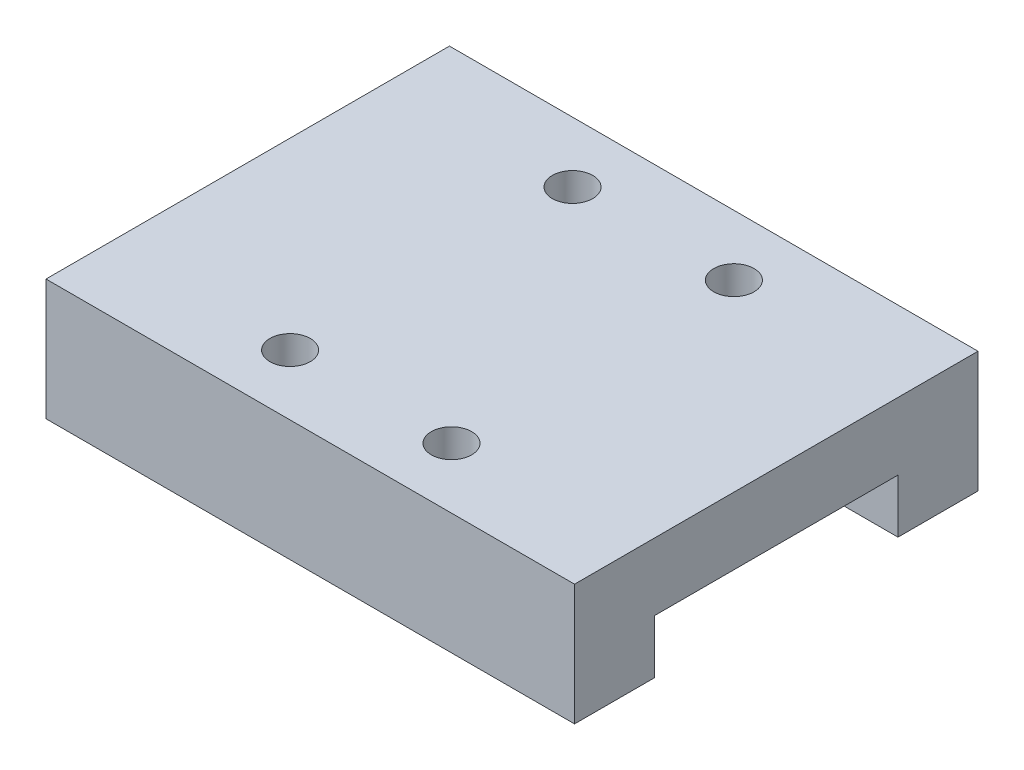
ISO-10303-21;
HEADER;
FILE_DESCRIPTION(('STEP AP214'),'2;1');
FILE_NAME('part.step','',(''),(''),'','','');
FILE_SCHEMA(('AUTOMOTIVE_DESIGN { 1 0 10303 214 1 1 1 1 }'));
ENDSEC;
DATA;
#1=APPLICATION_CONTEXT('core data for automotive mechanical design processes');
#2=APPLICATION_PROTOCOL_DEFINITION('international standard','automotive_design',2000,#1);
#3=PRODUCT_CONTEXT('',#1,'mechanical');
#4=PRODUCT('Part','Part','',(#3));
#5=PRODUCT_RELATED_PRODUCT_CATEGORY('part','',(#4));
#6=PRODUCT_DEFINITION_FORMATION('','',#4);
#7=PRODUCT_DEFINITION_CONTEXT('part definition',#1,'design');
#8=PRODUCT_DEFINITION('design','',#6,#7);
#9=PRODUCT_DEFINITION_SHAPE('','',#8);
#10=(LENGTH_UNIT() NAMED_UNIT(*) SI_UNIT(.MILLI.,.METRE.));
#11=(NAMED_UNIT(*) PLANE_ANGLE_UNIT() SI_UNIT($,.RADIAN.));
#12=(NAMED_UNIT(*) SI_UNIT($,.STERADIAN.) SOLID_ANGLE_UNIT());
#13=UNCERTAINTY_MEASURE_WITH_UNIT(LENGTH_MEASURE(1.E-05),#10,'distance_accuracy_value','');
#14=(GEOMETRIC_REPRESENTATION_CONTEXT(3) GLOBAL_UNCERTAINTY_ASSIGNED_CONTEXT((#13)) GLOBAL_UNIT_ASSIGNED_CONTEXT((#10,
#11,#12)) REPRESENTATION_CONTEXT('',''));
#15=CARTESIAN_POINT('',(0.,0.,0.));
#16=DIRECTION('',(0.,0.,1.));
#17=DIRECTION('',(1.,0.,0.));
#18=AXIS2_PLACEMENT_3D('',#15,#16,#17);
#19=CARTESIAN_POINT('',(0.,0.,0.));
#20=DIRECTION('',(0.,1.,0.));
#21=DIRECTION('',(0.,0.,1.));
#22=AXIS2_PLACEMENT_3D('',#19,#20,#21);
#23=PLANE('',#22);
#24=DIRECTION('',(0.,0.,1.));
#25=VECTOR('',#24,1.);
#26=CARTESIAN_POINT('',(-19.65,0.,-15.));
#27=LINE('',#26,#25);
#28=CARTESIAN_POINT('',(-19.65,0.,9.05));
#29=VERTEX_POINT('',#28);
#30=CARTESIAN_POINT('',(-19.65,0.,15.));
#31=VERTEX_POINT('',#30);
#32=EDGE_CURVE('E287',#29,#31,#27,.T.);
#33=ORIENTED_EDGE('',*,*,#32,.F.);
#34=DIRECTION('',(-1.,0.,0.));
#35=VECTOR('',#34,1.);
#36=CARTESIAN_POINT('',(-19.65,0.,9.05));
#37=LINE('',#36,#35);
#38=CARTESIAN_POINT('',(19.65,0.,9.05));
#39=VERTEX_POINT('',#38);
#40=EDGE_CURVE('E174',#39,#29,#37,.T.);
#41=ORIENTED_EDGE('',*,*,#40,.F.);
#42=DIRECTION('',(0.,0.,-1.));
#43=VECTOR('',#42,1.);
#44=CARTESIAN_POINT('',(19.65,0.,-15.));
#45=LINE('',#44,#43);
#46=CARTESIAN_POINT('',(19.65,0.,15.));
#47=VERTEX_POINT('',#46);
#48=EDGE_CURVE('E281',#47,#39,#45,.T.);
#49=ORIENTED_EDGE('',*,*,#48,.F.);
#50=DIRECTION('',(1.,0.,0.));
#51=VECTOR('',#50,1.);
#52=CARTESIAN_POINT('',(-19.65,0.,15.));
#53=LINE('',#52,#51);
#54=EDGE_CURVE('E271',#31,#47,#53,.T.);
#55=ORIENTED_EDGE('',*,*,#54,.F.);
#56=EDGE_LOOP('',(#33,#41,#49,#55));
#57=FACE_BOUND('',#56,.T.);
#58=ADVANCED_FACE('F39',(#57),#23,.F.);
#59=CARTESIAN_POINT('',(19.65,9.,-15.));
#60=DIRECTION('',(-1.,0.,0.));
#61=DIRECTION('',(0.,0.,1.));
#62=AXIS2_PLACEMENT_3D('',#59,#60,#61);
#63=PLANE('',#62);
#64=ORIENTED_EDGE('',*,*,#48,.T.);
#65=DIRECTION('',(0.,-1.,0.));
#66=VECTOR('',#65,1.);
#67=CARTESIAN_POINT('',(19.65,4.,9.05));
#68=LINE('',#67,#66);
#69=CARTESIAN_POINT('',(19.65,4.,9.05));
#70=VERTEX_POINT('',#69);
#71=EDGE_CURVE('E217',#70,#39,#68,.T.);
#72=ORIENTED_EDGE('',*,*,#71,.F.);
#73=DIRECTION('',(0.,0.,1.));
#74=VECTOR('',#73,1.);
#75=CARTESIAN_POINT('',(19.65,4.,9.05));
#76=LINE('',#75,#74);
#77=CARTESIAN_POINT('',(19.65,4.,-9.05));
#78=VERTEX_POINT('',#77);
#79=EDGE_CURVE('E160',#78,#70,#76,.T.);
#80=ORIENTED_EDGE('',*,*,#79,.F.);
#81=DIRECTION('',(0.,-1.,0.));
#82=VECTOR('',#81,1.);
#83=CARTESIAN_POINT('',(19.65,4.,-9.05));
#84=LINE('',#83,#82);
#85=CARTESIAN_POINT('',(19.65,0.,-9.05));
#86=VERTEX_POINT('',#85);
#87=EDGE_CURVE('E211',#78,#86,#84,.T.);
#88=ORIENTED_EDGE('',*,*,#87,.T.);
#89=CARTESIAN_POINT('',(19.65,0.,-15.));
#90=VERTEX_POINT('',#89);
#91=EDGE_CURVE('E252',#86,#90,#45,.T.);
#92=ORIENTED_EDGE('',*,*,#91,.T.);
#93=DIRECTION('',(0.,-1.,0.));
#94=VECTOR('',#93,1.);
#95=CARTESIAN_POINT('',(19.65,9.,-15.));
#96=LINE('',#95,#94);
#97=CARTESIAN_POINT('',(19.65,9.,-15.));
#98=VERTEX_POINT('',#97);
#99=EDGE_CURVE('E137',#98,#90,#96,.T.);
#100=ORIENTED_EDGE('',*,*,#99,.F.);
#101=DIRECTION('',(0.,0.,-1.));
#102=VECTOR('',#101,1.);
#103=CARTESIAN_POINT('',(19.65,9.,-15.));
#104=LINE('',#103,#102);
#105=CARTESIAN_POINT('',(19.65,9.,15.));
#106=VERTEX_POINT('',#105);
#107=EDGE_CURVE('E266',#106,#98,#104,.T.);
#108=ORIENTED_EDGE('',*,*,#107,.F.);
#109=DIRECTION('',(0.,-1.,0.));
#110=VECTOR('',#109,1.);
#111=CARTESIAN_POINT('',(19.65,9.,15.));
#112=LINE('',#111,#110);
#113=EDGE_CURVE('E280',#106,#47,#112,.T.);
#114=ORIENTED_EDGE('',*,*,#113,.T.);
#115=EDGE_LOOP('',(#64,#72,#80,#88,#92,#100,#108,#114));
#116=FACE_BOUND('',#115,.T.);
#117=ADVANCED_FACE('F41',(#116),#63,.F.);
#118=CARTESIAN_POINT('',(-19.65,9.,-15.));
#119=DIRECTION('',(0.,0.,1.));
#120=DIRECTION('',(1.,0.,0.));
#121=AXIS2_PLACEMENT_3D('',#118,#119,#120);
#122=PLANE('',#121);
#123=DIRECTION('',(-1.,0.,0.));
#124=VECTOR('',#123,1.);
#125=CARTESIAN_POINT('',(-19.65,0.,-15.));
#126=LINE('',#125,#124);
#127=CARTESIAN_POINT('',(-19.65,0.,-15.));
#128=VERTEX_POINT('',#127);
#129=EDGE_CURVE('E284',#90,#128,#126,.T.);
#130=ORIENTED_EDGE('',*,*,#129,.T.);
#131=DIRECTION('',(0.,-1.,0.));
#132=VECTOR('',#131,1.);
#133=CARTESIAN_POINT('',(-19.65,9.,-15.));
#134=LINE('',#133,#132);
#135=CARTESIAN_POINT('',(-19.65,9.,-15.));
#136=VERTEX_POINT('',#135);
#137=EDGE_CURVE('E299',#136,#128,#134,.T.);
#138=ORIENTED_EDGE('',*,*,#137,.F.);
#139=DIRECTION('',(-1.,0.,0.));
#140=VECTOR('',#139,1.);
#141=CARTESIAN_POINT('',(-19.65,9.,-15.));
#142=LINE('',#141,#140);
#143=EDGE_CURVE('E270',#98,#136,#142,.T.);
#144=ORIENTED_EDGE('',*,*,#143,.F.);
#145=ORIENTED_EDGE('',*,*,#99,.T.);
#146=EDGE_LOOP('',(#130,#138,#144,#145));
#147=FACE_BOUND('',#146,.T.);
#148=ADVANCED_FACE('F306',(#147),#122,.F.);
#149=CARTESIAN_POINT('',(-19.65,9.,-15.));
#150=DIRECTION('',(1.,0.,0.));
#151=DIRECTION('',(0.,0.,-1.));
#152=AXIS2_PLACEMENT_3D('',#149,#150,#151);
#153=PLANE('',#152);
#154=DIRECTION('',(0.,0.,-1.));
#155=VECTOR('',#154,1.);
#156=CARTESIAN_POINT('',(-19.65,4.,9.05));
#157=LINE('',#156,#155);
#158=CARTESIAN_POINT('',(-19.65,4.,9.05));
#159=VERTEX_POINT('',#158);
#160=CARTESIAN_POINT('',(-19.65,4.,-9.05));
#161=VERTEX_POINT('',#160);
#162=EDGE_CURVE('E157',#159,#161,#157,.T.);
#163=ORIENTED_EDGE('',*,*,#162,.F.);
#164=DIRECTION('',(0.,-1.,0.));
#165=VECTOR('',#164,1.);
#166=CARTESIAN_POINT('',(-19.65,4.,9.05));
#167=LINE('',#166,#165);
#168=EDGE_CURVE('E248',#159,#29,#167,.T.);
#169=ORIENTED_EDGE('',*,*,#168,.T.);
#170=ORIENTED_EDGE('',*,*,#32,.T.);
#171=DIRECTION('',(0.,-1.,0.));
#172=VECTOR('',#171,1.);
#173=CARTESIAN_POINT('',(-19.65,9.,15.));
#174=LINE('',#173,#172);
#175=CARTESIAN_POINT('',(-19.65,9.,15.));
#176=VERTEX_POINT('',#175);
#177=EDGE_CURVE('E295',#176,#31,#174,.T.);
#178=ORIENTED_EDGE('',*,*,#177,.F.);
#179=DIRECTION('',(0.,0.,1.));
#180=VECTOR('',#179,1.);
#181=CARTESIAN_POINT('',(-19.65,9.,-15.));
#182=LINE('',#181,#180);
#183=EDGE_CURVE('E274',#136,#176,#182,.T.);
#184=ORIENTED_EDGE('',*,*,#183,.F.);
#185=ORIENTED_EDGE('',*,*,#137,.T.);
#186=CARTESIAN_POINT('',(-19.65,0.,-9.05));
#187=VERTEX_POINT('',#186);
#188=EDGE_CURVE('E258',#128,#187,#27,.T.);
#189=ORIENTED_EDGE('',*,*,#188,.T.);
#190=DIRECTION('',(0.,-1.,0.));
#191=VECTOR('',#190,1.);
#192=CARTESIAN_POINT('',(-19.65,4.,-9.05));
#193=LINE('',#192,#191);
#194=EDGE_CURVE('E218',#161,#187,#193,.T.);
#195=ORIENTED_EDGE('',*,*,#194,.F.);
#196=EDGE_LOOP('',(#163,#169,#170,#178,#184,#185,#189,#195));
#197=FACE_BOUND('',#196,.T.);
#198=ADVANCED_FACE('F254',(#197),#153,.F.);
#199=CARTESIAN_POINT('',(-19.65,9.,15.));
#200=DIRECTION('',(0.,0.,-1.));
#201=DIRECTION('',(-1.,0.,0.));
#202=AXIS2_PLACEMENT_3D('',#199,#200,#201);
#203=PLANE('',#202);
#204=ORIENTED_EDGE('',*,*,#54,.T.);
#205=ORIENTED_EDGE('',*,*,#113,.F.);
#206=DIRECTION('',(1.,0.,0.));
#207=VECTOR('',#206,1.);
#208=CARTESIAN_POINT('',(-19.65,9.,15.));
#209=LINE('',#208,#207);
#210=EDGE_CURVE('E277',#176,#106,#209,.T.);
#211=ORIENTED_EDGE('',*,*,#210,.F.);
#212=ORIENTED_EDGE('',*,*,#177,.T.);
#213=EDGE_LOOP('',(#204,#205,#211,#212));
#214=FACE_BOUND('',#213,.T.);
#215=ADVANCED_FACE('F317',(#214),#203,.F.);
#216=CARTESIAN_POINT('',(0.,9.,0.));
#217=DIRECTION('',(0.,1.,0.));
#218=DIRECTION('',(0.,0.,1.));
#219=AXIS2_PLACEMENT_3D('',#216,#217,#218);
#220=PLANE('',#219);
#221=CARTESIAN_POINT('',(-6.,9.,10.5));
#222=DIRECTION('',(0.,1.,0.));
#223=DIRECTION('',(0.,0.,-1.));
#224=AXIS2_PLACEMENT_3D('',#221,#222,#223);
#225=CIRCLE('',#224,1.5);
#226=CARTESIAN_POINT('',(-6.,9.,9.));
#227=VERTEX_POINT('',#226);
#228=EDGE_CURVE('E182',#227,#227,#225,.T.);
#229=ORIENTED_EDGE('',*,*,#228,.F.);
#230=EDGE_LOOP('',(#229));
#231=FACE_BOUND('',#230,.T.);
#232=CARTESIAN_POINT('',(6.,9.,10.5));
#233=DIRECTION('',(0.,1.,0.));
#234=DIRECTION('',(0.,0.,1.));
#235=AXIS2_PLACEMENT_3D('',#232,#233,#234);
#236=CIRCLE('',#235,1.5);
#237=CARTESIAN_POINT('',(6.,9.,12.));
#238=VERTEX_POINT('',#237);
#239=EDGE_CURVE('E188',#238,#238,#236,.T.);
#240=ORIENTED_EDGE('',*,*,#239,.F.);
#241=EDGE_LOOP('',(#240));
#242=FACE_BOUND('',#241,.T.);
#243=CARTESIAN_POINT('',(6.,9.,-10.5));
#244=DIRECTION('',(0.,1.,0.));
#245=DIRECTION('',(0.,0.,-1.));
#246=AXIS2_PLACEMENT_3D('',#243,#244,#245);
#247=CIRCLE('',#246,1.5);
#248=CARTESIAN_POINT('',(6.,9.,-12.));
#249=VERTEX_POINT('',#248);
#250=EDGE_CURVE('E196',#249,#249,#247,.T.);
#251=ORIENTED_EDGE('',*,*,#250,.F.);
#252=EDGE_LOOP('',(#251));
#253=FACE_BOUND('',#252,.T.);
#254=CARTESIAN_POINT('',(-6.,9.,-10.5));
#255=DIRECTION('',(0.,1.,0.));
#256=DIRECTION('',(0.,0.,1.));
#257=AXIS2_PLACEMENT_3D('',#254,#255,#256);
#258=CIRCLE('',#257,1.5);
#259=CARTESIAN_POINT('',(-6.,9.,-9.));
#260=VERTEX_POINT('',#259);
#261=EDGE_CURVE('E144',#260,#260,#258,.T.);
#262=ORIENTED_EDGE('',*,*,#261,.F.);
#263=EDGE_LOOP('',(#262));
#264=FACE_BOUND('',#263,.T.);
#265=ORIENTED_EDGE('',*,*,#107,.T.);
#266=ORIENTED_EDGE('',*,*,#143,.T.);
#267=ORIENTED_EDGE('',*,*,#183,.T.);
#268=ORIENTED_EDGE('',*,*,#210,.T.);
#269=EDGE_LOOP('',(#265,#266,#267,#268));
#270=FACE_BOUND('',#269,.T.);
#271=ADVANCED_FACE('F328',(#231,#242,#253,#264,#270),#220,.T.);
#272=ORIENTED_EDGE('',*,*,#91,.F.);
#273=DIRECTION('',(1.,0.,0.));
#274=VECTOR('',#273,1.);
#275=CARTESIAN_POINT('',(-19.65,0.,-9.05));
#276=LINE('',#275,#274);
#277=EDGE_CURVE('E143',#187,#86,#276,.T.);
#278=ORIENTED_EDGE('',*,*,#277,.F.);
#279=ORIENTED_EDGE('',*,*,#188,.F.);
#280=ORIENTED_EDGE('',*,*,#129,.F.);
#281=EDGE_LOOP('',(#272,#278,#279,#280));
#282=FACE_BOUND('',#281,.T.);
#283=ADVANCED_FACE('F260',(#282),#23,.F.);
#284=CARTESIAN_POINT('',(-19.65,4.,9.05));
#285=DIRECTION('',(0.,0.,1.));
#286=DIRECTION('',(1.,0.,0.));
#287=AXIS2_PLACEMENT_3D('',#284,#285,#286);
#288=PLANE('',#287);
#289=ORIENTED_EDGE('',*,*,#40,.T.);
#290=ORIENTED_EDGE('',*,*,#168,.F.);
#291=DIRECTION('',(-1.,0.,0.));
#292=VECTOR('',#291,1.);
#293=CARTESIAN_POINT('',(-19.65,4.,9.05));
#294=LINE('',#293,#292);
#295=CARTESIAN_POINT('',(-6.38405728739344,4.,9.05));
#296=VERTEX_POINT('',#295);
#297=EDGE_CURVE('E163',#296,#159,#294,.T.);
#298=ORIENTED_EDGE('',*,*,#297,.F.);
#299=CARTESIAN_POINT('',(-5.61594271260656,4.,9.05));
#300=VERTEX_POINT('',#299);
#301=EDGE_CURVE('E239',#300,#296,#294,.T.);
#302=ORIENTED_EDGE('',*,*,#301,.F.);
#303=CARTESIAN_POINT('',(5.61594271260657,4.,9.05));
#304=VERTEX_POINT('',#303);
#305=EDGE_CURVE('E236',#304,#300,#294,.T.);
#306=ORIENTED_EDGE('',*,*,#305,.F.);
#307=CARTESIAN_POINT('',(6.38405728739344,4.,9.05));
#308=VERTEX_POINT('',#307);
#309=EDGE_CURVE('E230',#308,#304,#294,.T.);
#310=ORIENTED_EDGE('',*,*,#309,.F.);
#311=EDGE_CURVE('E224',#70,#308,#294,.T.);
#312=ORIENTED_EDGE('',*,*,#311,.F.);
#313=ORIENTED_EDGE('',*,*,#71,.T.);
#314=EDGE_LOOP('',(#289,#290,#298,#302,#306,#310,#312,#313));
#315=FACE_BOUND('',#314,.T.);
#316=ADVANCED_FACE('F227',(#315),#288,.F.);
#317=CARTESIAN_POINT('',(-19.65,4.,-9.05));
#318=DIRECTION('',(0.,0.,-1.));
#319=DIRECTION('',(-1.,0.,0.));
#320=AXIS2_PLACEMENT_3D('',#317,#318,#319);
#321=PLANE('',#320);
#322=ORIENTED_EDGE('',*,*,#277,.T.);
#323=ORIENTED_EDGE('',*,*,#87,.F.);
#324=DIRECTION('',(1.,0.,0.));
#325=VECTOR('',#324,1.);
#326=CARTESIAN_POINT('',(-19.65,4.,-9.05));
#327=LINE('',#326,#325);
#328=CARTESIAN_POINT('',(6.38405728739343,4.,-9.05));
#329=VERTEX_POINT('',#328);
#330=EDGE_CURVE('E161',#329,#78,#327,.T.);
#331=ORIENTED_EDGE('',*,*,#330,.F.);
#332=CARTESIAN_POINT('',(5.61594271260657,4.,-9.05));
#333=VERTEX_POINT('',#332);
#334=EDGE_CURVE('E167',#333,#329,#327,.T.);
#335=ORIENTED_EDGE('',*,*,#334,.F.);
#336=CARTESIAN_POINT('',(-5.61594271260657,4.,-9.05));
#337=VERTEX_POINT('',#336);
#338=EDGE_CURVE('E151',#337,#333,#327,.T.);
#339=ORIENTED_EDGE('',*,*,#338,.F.);
#340=CARTESIAN_POINT('',(-6.38405728739343,4.,-9.05));
#341=VERTEX_POINT('',#340);
#342=EDGE_CURVE('E141',#341,#337,#327,.T.);
#343=ORIENTED_EDGE('',*,*,#342,.F.);
#344=EDGE_CURVE('E148',#161,#341,#327,.T.);
#345=ORIENTED_EDGE('',*,*,#344,.F.);
#346=ORIENTED_EDGE('',*,*,#194,.T.);
#347=EDGE_LOOP('',(#322,#323,#331,#335,#339,#343,#345,#346));
#348=FACE_BOUND('',#347,.T.);
#349=ADVANCED_FACE('F147',(#348),#321,.F.);
#350=CARTESIAN_POINT('',(0.,4.,0.));
#351=DIRECTION('',(0.,-1.,0.));
#352=DIRECTION('',(0.,0.,-1.));
#353=AXIS2_PLACEMENT_3D('',#350,#351,#352);
#354=PLANE('',#353);
#355=CARTESIAN_POINT('',(-6.,4.,10.5));
#356=DIRECTION('',(0.,-1.,0.));
#357=DIRECTION('',(0.,0.,-1.));
#358=AXIS2_PLACEMENT_3D('',#355,#356,#357);
#359=CIRCLE('',#358,1.5);
#360=EDGE_CURVE('E11',#296,#300,#359,.T.);
#361=ORIENTED_EDGE('',*,*,#360,.F.);
#362=ORIENTED_EDGE('',*,*,#297,.T.);
#363=ORIENTED_EDGE('',*,*,#162,.T.);
#364=ORIENTED_EDGE('',*,*,#344,.T.);
#365=CARTESIAN_POINT('',(-6.,4.,-10.5));
#366=DIRECTION('',(0.,-1.,0.));
#367=DIRECTION('',(0.,0.,-1.));
#368=AXIS2_PLACEMENT_3D('',#365,#366,#367);
#369=CIRCLE('',#368,1.5);
#370=EDGE_CURVE('E48',#337,#341,#369,.T.);
#371=ORIENTED_EDGE('',*,*,#370,.F.);
#372=ORIENTED_EDGE('',*,*,#338,.T.);
#373=CARTESIAN_POINT('',(6.,4.,-10.5));
#374=DIRECTION('',(0.,1.,0.));
#375=DIRECTION('',(0.,0.,-1.));
#376=AXIS2_PLACEMENT_3D('',#373,#374,#375);
#377=CIRCLE('',#376,1.5);
#378=EDGE_CURVE('E180',#333,#329,#377,.T.);
#379=ORIENTED_EDGE('',*,*,#378,.T.);
#380=ORIENTED_EDGE('',*,*,#330,.T.);
#381=ORIENTED_EDGE('',*,*,#79,.T.);
#382=ORIENTED_EDGE('',*,*,#311,.T.);
#383=CARTESIAN_POINT('',(6.,4.,10.5));
#384=DIRECTION('',(0.,1.,0.));
#385=DIRECTION('',(0.,0.,1.));
#386=AXIS2_PLACEMENT_3D('',#383,#384,#385);
#387=CIRCLE('',#386,1.5);
#388=EDGE_CURVE('E192',#308,#304,#387,.T.);
#389=ORIENTED_EDGE('',*,*,#388,.T.);
#390=ORIENTED_EDGE('',*,*,#305,.T.);
#391=EDGE_LOOP('',(#361,#362,#363,#364,#371,#372,#379,#380,#381,#382,#389,#390));
#392=FACE_BOUND('',#391,.T.);
#393=ADVANCED_FACE('F155',(#392),#354,.T.);
#394=CARTESIAN_POINT('',(-6.,4.,-10.5));
#395=DIRECTION('',(0.,1.,0.));
#396=DIRECTION('',(0.,0.,1.));
#397=AXIS2_PLACEMENT_3D('',#394,#395,#396);
#398=PLANE('',#397);
#399=ORIENTED_EDGE('',*,*,#342,.T.);
#400=CARTESIAN_POINT('',(-6.,4.,-10.5));
#401=DIRECTION('',(0.,1.,0.));
#402=DIRECTION('',(0.,0.,1.));
#403=AXIS2_PLACEMENT_3D('',#400,#401,#402);
#404=CIRCLE('',#403,1.5);
#405=EDGE_CURVE('E130',#337,#341,#404,.T.);
#406=ORIENTED_EDGE('',*,*,#405,.T.);
#407=EDGE_LOOP('',(#399,#406));
#408=FACE_BOUND('',#407,.T.);
#409=ADVANCED_FACE('F140',(#408),#398,.T.);
#410=CARTESIAN_POINT('',(-6.,4.,-10.5));
#411=DIRECTION('',(0.,1.,0.));
#412=DIRECTION('',(0.,0.,1.));
#413=AXIS2_PLACEMENT_3D('',#410,#411,#412);
#414=CYLINDRICAL_SURFACE('',#413,1.5);
#415=ORIENTED_EDGE('',*,*,#405,.F.);
#416=ORIENTED_EDGE('',*,*,#370,.T.);
#417=EDGE_LOOP('',(#415,#416));
#418=FACE_BOUND('',#417,.T.);
#419=ORIENTED_EDGE('',*,*,#261,.T.);
#420=EDGE_LOOP('',(#419));
#421=FACE_BOUND('',#420,.T.);
#422=ADVANCED_FACE('F128',(#418,#421),#414,.F.);
#423=CARTESIAN_POINT('',(6.,4.,-10.5));
#424=DIRECTION('',(0.,-1.,0.));
#425=DIRECTION('',(0.,0.,-1.));
#426=AXIS2_PLACEMENT_3D('',#423,#424,#425);
#427=PLANE('',#426);
#428=EDGE_CURVE('E200',#329,#333,#377,.T.);
#429=ORIENTED_EDGE('',*,*,#428,.T.);
#430=ORIENTED_EDGE('',*,*,#334,.T.);
#431=EDGE_LOOP('',(#429,#430));
#432=FACE_BOUND('',#431,.T.);
#433=ADVANCED_FACE('F205',(#432),#427,.F.);
#434=CARTESIAN_POINT('',(6.,4.,-10.5));
#435=DIRECTION('',(0.,1.,0.));
#436=DIRECTION('',(0.,0.,1.));
#437=AXIS2_PLACEMENT_3D('',#434,#435,#436);
#438=CYLINDRICAL_SURFACE('',#437,1.5);
#439=ORIENTED_EDGE('',*,*,#378,.F.);
#440=ORIENTED_EDGE('',*,*,#428,.F.);
#441=EDGE_LOOP('',(#439,#440));
#442=FACE_BOUND('',#441,.T.);
#443=ORIENTED_EDGE('',*,*,#250,.T.);
#444=EDGE_LOOP('',(#443));
#445=FACE_BOUND('',#444,.T.);
#446=ADVANCED_FACE('F207',(#442,#445),#438,.F.);
#447=CARTESIAN_POINT('',(6.,4.,10.5));
#448=DIRECTION('',(0.,1.,0.));
#449=DIRECTION('',(0.,0.,1.));
#450=AXIS2_PLACEMENT_3D('',#447,#448,#449);
#451=PLANE('',#450);
#452=ORIENTED_EDGE('',*,*,#309,.T.);
#453=EDGE_CURVE('E60',#304,#308,#387,.T.);
#454=ORIENTED_EDGE('',*,*,#453,.T.);
#455=EDGE_LOOP('',(#452,#454));
#456=FACE_BOUND('',#455,.T.);
#457=ADVANCED_FACE('F358',(#456),#451,.T.);
#458=CARTESIAN_POINT('',(6.,4.,10.5));
#459=DIRECTION('',(0.,1.,0.));
#460=DIRECTION('',(0.,0.,1.));
#461=AXIS2_PLACEMENT_3D('',#458,#459,#460);
#462=CYLINDRICAL_SURFACE('',#461,1.5);
#463=ORIENTED_EDGE('',*,*,#388,.F.);
#464=ORIENTED_EDGE('',*,*,#453,.F.);
#465=EDGE_LOOP('',(#463,#464));
#466=FACE_BOUND('',#465,.T.);
#467=ORIENTED_EDGE('',*,*,#239,.T.);
#468=EDGE_LOOP('',(#467));
#469=FACE_BOUND('',#468,.T.);
#470=ADVANCED_FACE('F355',(#466,#469),#462,.F.);
#471=CARTESIAN_POINT('',(-6.,4.,10.5));
#472=DIRECTION('',(0.,-1.,0.));
#473=DIRECTION('',(0.,0.,-1.));
#474=AXIS2_PLACEMENT_3D('',#471,#472,#473);
#475=PLANE('',#474);
#476=CARTESIAN_POINT('',(-6.,4.,10.5));
#477=DIRECTION('',(0.,1.,0.));
#478=DIRECTION('',(0.,0.,-1.));
#479=AXIS2_PLACEMENT_3D('',#476,#477,#478);
#480=CIRCLE('',#479,1.5);
#481=EDGE_CURVE('E53',#296,#300,#480,.T.);
#482=ORIENTED_EDGE('',*,*,#481,.T.);
#483=ORIENTED_EDGE('',*,*,#301,.T.);
#484=EDGE_LOOP('',(#482,#483));
#485=FACE_BOUND('',#484,.T.);
#486=ADVANCED_FACE('F352',(#485),#475,.F.);
#487=CARTESIAN_POINT('',(-6.,4.,10.5));
#488=DIRECTION('',(0.,1.,0.));
#489=DIRECTION('',(0.,0.,1.));
#490=AXIS2_PLACEMENT_3D('',#487,#488,#489);
#491=CYLINDRICAL_SURFACE('',#490,1.5);
#492=ORIENTED_EDGE('',*,*,#481,.F.);
#493=ORIENTED_EDGE('',*,*,#360,.T.);
#494=EDGE_LOOP('',(#492,#493));
#495=FACE_BOUND('',#494,.T.);
#496=ORIENTED_EDGE('',*,*,#228,.T.);
#497=EDGE_LOOP('',(#496));
#498=FACE_BOUND('',#497,.T.);
#499=ADVANCED_FACE('F349',(#495,#498),#491,.F.);
#500=CLOSED_SHELL('',(#58,#117,#148,#198,#215,#271,#283,#316,#349,#393,#409,#422,#433,#446,#457,
#470,#486,#499));
#501=MANIFOLD_SOLID_BREP('B2',#500);
#502=ADVANCED_BREP_SHAPE_REPRESENTATION('',(#18,#501),#14);
#503=SHAPE_DEFINITION_REPRESENTATION(#9,#502);
ENDSEC;
END-ISO-10303-21;
